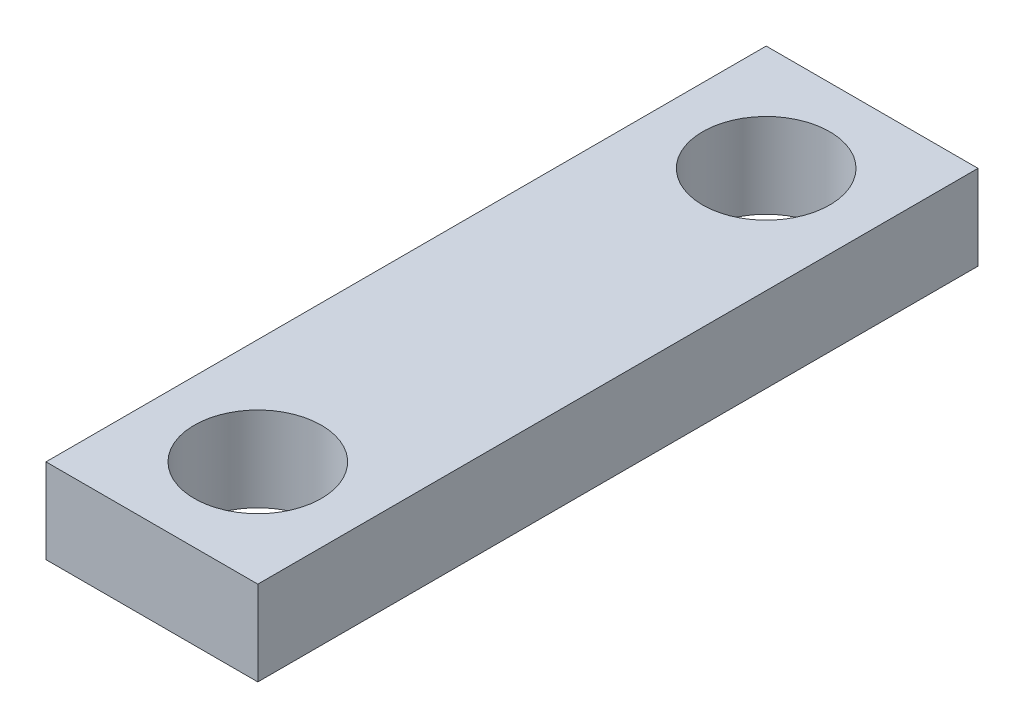
ISO-10303-21;
HEADER;
FILE_DESCRIPTION(('STEP AP214'),'2;1');
FILE_NAME('part.step','',(''),(''),'','','');
FILE_SCHEMA(('AUTOMOTIVE_DESIGN { 1 0 10303 214 1 1 1 1 }'));
ENDSEC;
DATA;
#1=APPLICATION_CONTEXT('core data for automotive mechanical design processes');
#2=APPLICATION_PROTOCOL_DEFINITION('international standard','automotive_design',2000,#1);
#3=PRODUCT_CONTEXT('',#1,'mechanical');
#4=PRODUCT('Part','Part','',(#3));
#5=PRODUCT_RELATED_PRODUCT_CATEGORY('part','',(#4));
#6=PRODUCT_DEFINITION_FORMATION('','',#4);
#7=PRODUCT_DEFINITION_CONTEXT('part definition',#1,'design');
#8=PRODUCT_DEFINITION('design','',#6,#7);
#9=PRODUCT_DEFINITION_SHAPE('','',#8);
#10=(LENGTH_UNIT() NAMED_UNIT(*) SI_UNIT(.MILLI.,.METRE.));
#11=(NAMED_UNIT(*) PLANE_ANGLE_UNIT() SI_UNIT($,.RADIAN.));
#12=(NAMED_UNIT(*) SI_UNIT($,.STERADIAN.) SOLID_ANGLE_UNIT());
#13=UNCERTAINTY_MEASURE_WITH_UNIT(LENGTH_MEASURE(1.E-05),#10,'distance_accuracy_value','');
#14=(GEOMETRIC_REPRESENTATION_CONTEXT(3) GLOBAL_UNCERTAINTY_ASSIGNED_CONTEXT((#13)) GLOBAL_UNIT_ASSIGNED_CONTEXT((#10,
#11,#12)) REPRESENTATION_CONTEXT('',''));
#15=CARTESIAN_POINT('',(0.,0.,0.));
#16=DIRECTION('',(0.,0.,1.));
#17=DIRECTION('',(1.,0.,0.));
#18=AXIS2_PLACEMENT_3D('',#15,#16,#17);
#19=CARTESIAN_POINT('',(0.,2.54,0.));
#20=DIRECTION('',(0.,-1.,0.));
#21=DIRECTION('',(0.,0.,-1.));
#22=AXIS2_PLACEMENT_3D('',#19,#20,#21);
#23=PLANE('',#22);
#24=DIRECTION('',(0.,0.,1.));
#25=VECTOR('',#24,1.);
#26=CARTESIAN_POINT('',(-3.175,2.54,10.795));
#27=LINE('',#26,#25);
#28=CARTESIAN_POINT('',(-3.175,2.54,-10.795));
#29=VERTEX_POINT('',#28);
#30=CARTESIAN_POINT('',(-3.175,2.54,10.795));
#31=VERTEX_POINT('',#30);
#32=EDGE_CURVE('E98',#29,#31,#27,.T.);
#33=ORIENTED_EDGE('',*,*,#32,.T.);
#34=DIRECTION('',(1.,0.,0.));
#35=VECTOR('',#34,1.);
#36=CARTESIAN_POINT('',(-3.175,2.54,10.795));
#37=LINE('',#36,#35);
#38=CARTESIAN_POINT('',(3.175,2.54,10.795));
#39=VERTEX_POINT('',#38);
#40=EDGE_CURVE('E93',#31,#39,#37,.T.);
#41=ORIENTED_EDGE('',*,*,#40,.T.);
#42=DIRECTION('',(0.,0.,-1.));
#43=VECTOR('',#42,1.);
#44=CARTESIAN_POINT('',(3.175,2.54,10.795));
#45=LINE('',#44,#43);
#46=CARTESIAN_POINT('',(3.175,2.54,-10.795));
#47=VERTEX_POINT('',#46);
#48=EDGE_CURVE('E96',#39,#47,#45,.T.);
#49=ORIENTED_EDGE('',*,*,#48,.T.);
#50=DIRECTION('',(-1.,0.,0.));
#51=VECTOR('',#50,1.);
#52=CARTESIAN_POINT('',(-3.175,2.54,-10.795));
#53=LINE('',#52,#51);
#54=EDGE_CURVE('E63',#47,#29,#53,.T.);
#55=ORIENTED_EDGE('',*,*,#54,.T.);
#56=EDGE_LOOP('',(#33,#41,#49,#55));
#57=FACE_BOUND('',#56,.T.);
#58=CARTESIAN_POINT('',(0.,2.54,-7.62));
#59=DIRECTION('',(0.,1.,0.));
#60=DIRECTION('',(0.,0.,1.));
#61=AXIS2_PLACEMENT_3D('',#58,#59,#60);
#62=CIRCLE('',#61,1.905);
#63=CARTESIAN_POINT('',(0.,2.54,-5.715));
#64=VERTEX_POINT('',#63);
#65=EDGE_CURVE('E118',#64,#64,#62,.T.);
#66=ORIENTED_EDGE('',*,*,#65,.F.);
#67=EDGE_LOOP('',(#66));
#68=FACE_BOUND('',#67,.T.);
#69=CARTESIAN_POINT('',(0.,2.54,7.62));
#70=DIRECTION('',(0.,1.,0.));
#71=DIRECTION('',(0.,0.,-1.));
#72=AXIS2_PLACEMENT_3D('',#69,#70,#71);
#73=CIRCLE('',#72,1.905);
#74=CARTESIAN_POINT('',(0.,2.54,5.715));
#75=VERTEX_POINT('',#74);
#76=EDGE_CURVE('E140',#75,#75,#73,.T.);
#77=ORIENTED_EDGE('',*,*,#76,.F.);
#78=EDGE_LOOP('',(#77));
#79=FACE_BOUND('',#78,.T.);
#80=ADVANCED_FACE('F45',(#57,#68,#79),#23,.F.);
#81=CARTESIAN_POINT('',(0.,0.,0.));
#82=DIRECTION('',(0.,-1.,0.));
#83=DIRECTION('',(0.,0.,-1.));
#84=AXIS2_PLACEMENT_3D('',#81,#82,#83);
#85=PLANE('',#84);
#86=CARTESIAN_POINT('',(0.,0.,-7.62));
#87=DIRECTION('',(0.,1.,0.));
#88=DIRECTION('',(0.,0.,1.));
#89=AXIS2_PLACEMENT_3D('',#86,#87,#88);
#90=CIRCLE('',#89,1.905);
#91=CARTESIAN_POINT('',(0.,0.,-5.715));
#92=VERTEX_POINT('',#91);
#93=EDGE_CURVE('E136',#92,#92,#90,.T.);
#94=ORIENTED_EDGE('',*,*,#93,.T.);
#95=EDGE_LOOP('',(#94));
#96=FACE_BOUND('',#95,.T.);
#97=DIRECTION('',(0.,0.,1.));
#98=VECTOR('',#97,1.);
#99=CARTESIAN_POINT('',(-3.175,0.,10.795));
#100=LINE('',#99,#98);
#101=CARTESIAN_POINT('',(-3.175,0.,-10.795));
#102=VERTEX_POINT('',#101);
#103=CARTESIAN_POINT('',(-3.175,0.,10.795));
#104=VERTEX_POINT('',#103);
#105=EDGE_CURVE('E114',#102,#104,#100,.T.);
#106=ORIENTED_EDGE('',*,*,#105,.F.);
#107=DIRECTION('',(-1.,0.,0.));
#108=VECTOR('',#107,1.);
#109=CARTESIAN_POINT('',(-3.175,0.,-10.795));
#110=LINE('',#109,#108);
#111=CARTESIAN_POINT('',(3.175,0.,-10.795));
#112=VERTEX_POINT('',#111);
#113=EDGE_CURVE('E86',#112,#102,#110,.T.);
#114=ORIENTED_EDGE('',*,*,#113,.F.);
#115=DIRECTION('',(0.,0.,-1.));
#116=VECTOR('',#115,1.);
#117=CARTESIAN_POINT('',(3.175,0.,10.795));
#118=LINE('',#117,#116);
#119=CARTESIAN_POINT('',(3.175,0.,10.795));
#120=VERTEX_POINT('',#119);
#121=EDGE_CURVE('E80',#120,#112,#118,.T.);
#122=ORIENTED_EDGE('',*,*,#121,.F.);
#123=DIRECTION('',(1.,0.,0.));
#124=VECTOR('',#123,1.);
#125=CARTESIAN_POINT('',(-3.175,0.,10.795));
#126=LINE('',#125,#124);
#127=EDGE_CURVE('E103',#104,#120,#126,.T.);
#128=ORIENTED_EDGE('',*,*,#127,.F.);
#129=EDGE_LOOP('',(#106,#114,#122,#128));
#130=FACE_BOUND('',#129,.T.);
#131=CARTESIAN_POINT('',(0.,0.,7.62));
#132=DIRECTION('',(0.,1.,0.));
#133=DIRECTION('',(0.,0.,-1.));
#134=AXIS2_PLACEMENT_3D('',#131,#132,#133);
#135=CIRCLE('',#134,1.905);
#136=CARTESIAN_POINT('',(0.,0.,5.715));
#137=VERTEX_POINT('',#136);
#138=EDGE_CURVE('E144',#137,#137,#135,.T.);
#139=ORIENTED_EDGE('',*,*,#138,.T.);
#140=EDGE_LOOP('',(#139));
#141=FACE_BOUND('',#140,.T.);
#142=ADVANCED_FACE('F131',(#96,#130,#141),#85,.T.);
#143=CARTESIAN_POINT('',(-3.175,2.54,10.795));
#144=DIRECTION('',(1.,0.,0.));
#145=DIRECTION('',(0.,0.,-1.));
#146=AXIS2_PLACEMENT_3D('',#143,#144,#145);
#147=PLANE('',#146);
#148=ORIENTED_EDGE('',*,*,#105,.T.);
#149=DIRECTION('',(0.,-1.,0.));
#150=VECTOR('',#149,1.);
#151=CARTESIAN_POINT('',(-3.175,2.54,10.795));
#152=LINE('',#151,#150);
#153=EDGE_CURVE('E11',#31,#104,#152,.T.);
#154=ORIENTED_EDGE('',*,*,#153,.F.);
#155=ORIENTED_EDGE('',*,*,#32,.F.);
#156=DIRECTION('',(0.,-1.,0.));
#157=VECTOR('',#156,1.);
#158=CARTESIAN_POINT('',(-3.175,2.54,-10.795));
#159=LINE('',#158,#157);
#160=EDGE_CURVE('E110',#29,#102,#159,.T.);
#161=ORIENTED_EDGE('',*,*,#160,.T.);
#162=EDGE_LOOP('',(#148,#154,#155,#161));
#163=FACE_BOUND('',#162,.T.);
#164=ADVANCED_FACE('F47',(#163),#147,.F.);
#165=CARTESIAN_POINT('',(-3.175,2.54,10.795));
#166=DIRECTION('',(0.,0.,-1.));
#167=DIRECTION('',(-1.,0.,0.));
#168=AXIS2_PLACEMENT_3D('',#165,#166,#167);
#169=PLANE('',#168);
#170=ORIENTED_EDGE('',*,*,#127,.T.);
#171=DIRECTION('',(0.,-1.,0.));
#172=VECTOR('',#171,1.);
#173=CARTESIAN_POINT('',(3.175,2.54,10.795));
#174=LINE('',#173,#172);
#175=EDGE_CURVE('E55',#39,#120,#174,.T.);
#176=ORIENTED_EDGE('',*,*,#175,.F.);
#177=ORIENTED_EDGE('',*,*,#40,.F.);
#178=ORIENTED_EDGE('',*,*,#153,.T.);
#179=EDGE_LOOP('',(#170,#176,#177,#178));
#180=FACE_BOUND('',#179,.T.);
#181=ADVANCED_FACE('F102',(#180),#169,.F.);
#182=CARTESIAN_POINT('',(3.175,2.54,10.795));
#183=DIRECTION('',(-1.,0.,0.));
#184=DIRECTION('',(0.,0.,1.));
#185=AXIS2_PLACEMENT_3D('',#182,#183,#184);
#186=PLANE('',#185);
#187=ORIENTED_EDGE('',*,*,#121,.T.);
#188=DIRECTION('',(0.,-1.,0.));
#189=VECTOR('',#188,1.);
#190=CARTESIAN_POINT('',(3.175,2.54,-10.795));
#191=LINE('',#190,#189);
#192=EDGE_CURVE('E105',#47,#112,#191,.T.);
#193=ORIENTED_EDGE('',*,*,#192,.F.);
#194=ORIENTED_EDGE('',*,*,#48,.F.);
#195=ORIENTED_EDGE('',*,*,#175,.T.);
#196=EDGE_LOOP('',(#187,#193,#194,#195));
#197=FACE_BOUND('',#196,.T.);
#198=ADVANCED_FACE('F106',(#197),#186,.F.);
#199=CARTESIAN_POINT('',(-3.175,2.54,-10.795));
#200=DIRECTION('',(0.,0.,1.));
#201=DIRECTION('',(1.,0.,0.));
#202=AXIS2_PLACEMENT_3D('',#199,#200,#201);
#203=PLANE('',#202);
#204=ORIENTED_EDGE('',*,*,#113,.T.);
#205=ORIENTED_EDGE('',*,*,#160,.F.);
#206=ORIENTED_EDGE('',*,*,#54,.F.);
#207=ORIENTED_EDGE('',*,*,#192,.T.);
#208=EDGE_LOOP('',(#204,#205,#206,#207));
#209=FACE_BOUND('',#208,.T.);
#210=ADVANCED_FACE('F128',(#209),#203,.F.);
#211=CARTESIAN_POINT('',(0.,2.54,-7.62));
#212=DIRECTION('',(0.,-1.,0.));
#213=DIRECTION('',(0.,0.,-1.));
#214=AXIS2_PLACEMENT_3D('',#211,#212,#213);
#215=CYLINDRICAL_SURFACE('',#214,1.905);
#216=ORIENTED_EDGE('',*,*,#65,.T.);
#217=EDGE_LOOP('',(#216));
#218=FACE_BOUND('',#217,.T.);
#219=ORIENTED_EDGE('',*,*,#93,.F.);
#220=EDGE_LOOP('',(#219));
#221=FACE_BOUND('',#220,.T.);
#222=ADVANCED_FACE('F163',(#218,#221),#215,.F.);
#223=CARTESIAN_POINT('',(0.,2.54,7.62));
#224=DIRECTION('',(0.,-1.,0.));
#225=DIRECTION('',(0.,0.,-1.));
#226=AXIS2_PLACEMENT_3D('',#223,#224,#225);
#227=CYLINDRICAL_SURFACE('',#226,1.905);
#228=ORIENTED_EDGE('',*,*,#76,.T.);
#229=EDGE_LOOP('',(#228));
#230=FACE_BOUND('',#229,.T.);
#231=ORIENTED_EDGE('',*,*,#138,.F.);
#232=EDGE_LOOP('',(#231));
#233=FACE_BOUND('',#232,.T.);
#234=ADVANCED_FACE('F152',(#230,#233),#227,.F.);
#235=CLOSED_SHELL('',(#80,#142,#164,#181,#198,#210,#222,#234));
#236=MANIFOLD_SOLID_BREP('B2',#235);
#237=ADVANCED_BREP_SHAPE_REPRESENTATION('',(#18,#236),#14);
#238=SHAPE_DEFINITION_REPRESENTATION(#9,#237);
ENDSEC;
END-ISO-10303-21;
